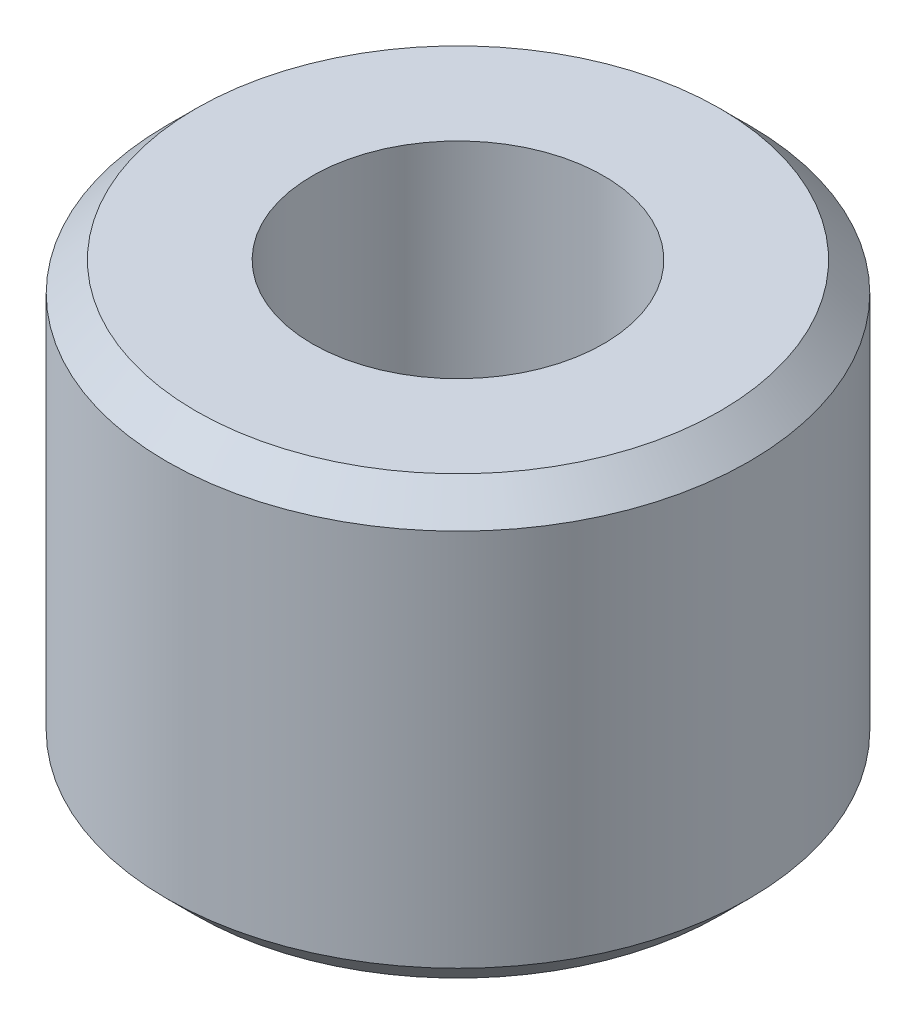
ISO-10303-21;
HEADER;
FILE_DESCRIPTION(('STEP AP214'),'2;1');
FILE_NAME('part.step','',(''),(''),'','','');
FILE_SCHEMA(('AUTOMOTIVE_DESIGN { 1 0 10303 214 1 1 1 1 }'));
ENDSEC;
DATA;
#1=APPLICATION_CONTEXT('core data for automotive mechanical design processes');
#2=APPLICATION_PROTOCOL_DEFINITION('international standard','automotive_design',2000,#1);
#3=PRODUCT_CONTEXT('',#1,'mechanical');
#4=PRODUCT('Part','Part','',(#3));
#5=PRODUCT_RELATED_PRODUCT_CATEGORY('part','',(#4));
#6=PRODUCT_DEFINITION_FORMATION('','',#4);
#7=PRODUCT_DEFINITION_CONTEXT('part definition',#1,'design');
#8=PRODUCT_DEFINITION('design','',#6,#7);
#9=PRODUCT_DEFINITION_SHAPE('','',#8);
#10=(LENGTH_UNIT() NAMED_UNIT(*) SI_UNIT(.MILLI.,.METRE.));
#11=(NAMED_UNIT(*) PLANE_ANGLE_UNIT() SI_UNIT($,.RADIAN.));
#12=(NAMED_UNIT(*) SI_UNIT($,.STERADIAN.) SOLID_ANGLE_UNIT());
#13=UNCERTAINTY_MEASURE_WITH_UNIT(LENGTH_MEASURE(1.E-05),#10,'distance_accuracy_value','');
#14=(GEOMETRIC_REPRESENTATION_CONTEXT(3) GLOBAL_UNCERTAINTY_ASSIGNED_CONTEXT((#13)) GLOBAL_UNIT_ASSIGNED_CONTEXT((#10,
#11,#12)) REPRESENTATION_CONTEXT('',''));
#15=CARTESIAN_POINT('',(0.,0.,0.));
#16=DIRECTION('',(0.,0.,1.));
#17=DIRECTION('',(1.,0.,0.));
#18=AXIS2_PLACEMENT_3D('',#15,#16,#17);
#19=CARTESIAN_POINT('',(0.,15.,0.));
#20=DIRECTION('',(0.,-1.,0.));
#21=DIRECTION('',(0.,0.,-1.));
#22=AXIS2_PLACEMENT_3D('',#19,#20,#21);
#23=CYLINDRICAL_SURFACE('',#22,10.);
#24=CARTESIAN_POINT('',(0.,1.,0.));
#25=DIRECTION('',(0.,1.,0.));
#26=DIRECTION('',(0.,0.,1.));
#27=AXIS2_PLACEMENT_3D('',#24,#25,#26);
#28=CIRCLE('',#27,10.);
#29=CARTESIAN_POINT('',(0.,1.,10.));
#30=VERTEX_POINT('',#29);
#31=EDGE_CURVE('E44',#30,#30,#28,.T.);
#32=ORIENTED_EDGE('',*,*,#31,.T.);
#33=EDGE_LOOP('',(#32));
#34=FACE_BOUND('',#33,.T.);
#35=CARTESIAN_POINT('',(0.,14.,0.));
#36=DIRECTION('',(0.,1.,0.));
#37=DIRECTION('',(0.,0.,1.));
#38=AXIS2_PLACEMENT_3D('',#35,#36,#37);
#39=CIRCLE('',#38,10.);
#40=CARTESIAN_POINT('',(0.,14.,10.));
#41=VERTEX_POINT('',#40);
#42=EDGE_CURVE('E48',#41,#41,#39,.F.);
#43=ORIENTED_EDGE('',*,*,#42,.T.);
#44=EDGE_LOOP('',(#43));
#45=FACE_BOUND('',#44,.T.);
#46=ADVANCED_FACE('F33',(#34,#45),#23,.T.);
#47=CARTESIAN_POINT('',(0.,15.,0.));
#48=DIRECTION('',(0.,1.,0.));
#49=DIRECTION('',(0.,0.,1.));
#50=AXIS2_PLACEMENT_3D('',#47,#48,#49);
#51=PLANE('',#50);
#52=CARTESIAN_POINT('',(0.,15.,0.));
#53=DIRECTION('',(0.,1.,0.));
#54=DIRECTION('',(0.,0.,1.));
#55=AXIS2_PLACEMENT_3D('',#52,#53,#54);
#56=CIRCLE('',#55,9.00000000000001);
#57=CARTESIAN_POINT('',(0.,15.,9.00000000000001));
#58=VERTEX_POINT('',#57);
#59=EDGE_CURVE('E10',#58,#58,#56,.T.);
#60=ORIENTED_EDGE('',*,*,#59,.T.);
#61=EDGE_LOOP('',(#60));
#62=FACE_BOUND('',#61,.T.);
#63=CARTESIAN_POINT('',(0.,15.,0.));
#64=DIRECTION('',(0.,1.,0.));
#65=DIRECTION('',(0.,0.,1.));
#66=AXIS2_PLACEMENT_3D('',#63,#64,#65);
#67=CIRCLE('',#66,5.);
#68=CARTESIAN_POINT('',(0.,15.,5.));
#69=VERTEX_POINT('',#68);
#70=EDGE_CURVE('E54',#69,#69,#67,.T.);
#71=ORIENTED_EDGE('',*,*,#70,.F.);
#72=EDGE_LOOP('',(#71));
#73=FACE_BOUND('',#72,.T.);
#74=ADVANCED_FACE('F69',(#62,#73),#51,.T.);
#75=CARTESIAN_POINT('',(0.,0.,0.));
#76=DIRECTION('',(0.,1.,0.));
#77=DIRECTION('',(0.,0.,1.));
#78=AXIS2_PLACEMENT_3D('',#75,#76,#77);
#79=PLANE('',#78);
#80=CARTESIAN_POINT('',(0.,0.,0.));
#81=DIRECTION('',(0.,1.,0.));
#82=DIRECTION('',(0.,0.,1.));
#83=AXIS2_PLACEMENT_3D('',#80,#81,#82);
#84=CIRCLE('',#83,8.99999999999999);
#85=CARTESIAN_POINT('',(0.,0.,8.99999999999999));
#86=VERTEX_POINT('',#85);
#87=EDGE_CURVE('E40',#86,#86,#84,.F.);
#88=ORIENTED_EDGE('',*,*,#87,.T.);
#89=EDGE_LOOP('',(#88));
#90=FACE_BOUND('',#89,.T.);
#91=CARTESIAN_POINT('',(0.,0.,0.));
#92=DIRECTION('',(0.,1.,0.));
#93=DIRECTION('',(0.,0.,1.));
#94=AXIS2_PLACEMENT_3D('',#91,#92,#93);
#95=CIRCLE('',#94,5.);
#96=CARTESIAN_POINT('',(0.,0.,5.));
#97=VERTEX_POINT('',#96);
#98=EDGE_CURVE('E53',#97,#97,#95,.T.);
#99=ORIENTED_EDGE('',*,*,#98,.T.);
#100=EDGE_LOOP('',(#99));
#101=FACE_BOUND('',#100,.T.);
#102=ADVANCED_FACE('F60',(#90,#101),#79,.F.);
#103=CARTESIAN_POINT('',(0.,0.,0.));
#104=DIRECTION('',(0.,1.,0.));
#105=DIRECTION('',(0.,0.,1.));
#106=AXIS2_PLACEMENT_3D('',#103,#104,#105);
#107=CYLINDRICAL_SURFACE('',#106,5.);
#108=ORIENTED_EDGE('',*,*,#98,.F.);
#109=EDGE_LOOP('',(#108));
#110=FACE_BOUND('',#109,.T.);
#111=ORIENTED_EDGE('',*,*,#70,.T.);
#112=EDGE_LOOP('',(#111));
#113=FACE_BOUND('',#112,.T.);
#114=ADVANCED_FACE('F62',(#110,#113),#107,.F.);
#115=CARTESIAN_POINT('',(0.,1.,0.));
#116=DIRECTION('',(0.,1.,0.));
#117=DIRECTION('',(0.,0.,1.));
#118=AXIS2_PLACEMENT_3D('',#115,#116,#117);
#119=CONICAL_SURFACE('',#118,10.,0.785398163397452);
#120=ORIENTED_EDGE('',*,*,#87,.F.);
#121=EDGE_LOOP('',(#120));
#122=FACE_BOUND('',#121,.T.);
#123=ORIENTED_EDGE('',*,*,#31,.F.);
#124=EDGE_LOOP('',(#123));
#125=FACE_BOUND('',#124,.T.);
#126=ADVANCED_FACE('F65',(#122,#125),#119,.T.);
#127=CARTESIAN_POINT('',(0.,15.,0.));
#128=DIRECTION('',(0.,-1.,0.));
#129=DIRECTION('',(0.,0.,-1.));
#130=AXIS2_PLACEMENT_3D('',#127,#128,#129);
#131=CONICAL_SURFACE('',#130,9.00000000000001,0.785398163397447);
#132=ORIENTED_EDGE('',*,*,#42,.F.);
#133=EDGE_LOOP('',(#132));
#134=FACE_BOUND('',#133,.T.);
#135=ORIENTED_EDGE('',*,*,#59,.F.);
#136=EDGE_LOOP('',(#135));
#137=FACE_BOUND('',#136,.T.);
#138=ADVANCED_FACE('F35',(#134,#137),#131,.T.);
#139=CLOSED_SHELL('',(#46,#74,#102,#114,#126,#138));
#140=MANIFOLD_SOLID_BREP('B2',#139);
#141=ADVANCED_BREP_SHAPE_REPRESENTATION('',(#18,#140),#14);
#142=SHAPE_DEFINITION_REPRESENTATION(#9,#141);
ENDSEC;
END-ISO-10303-21;
